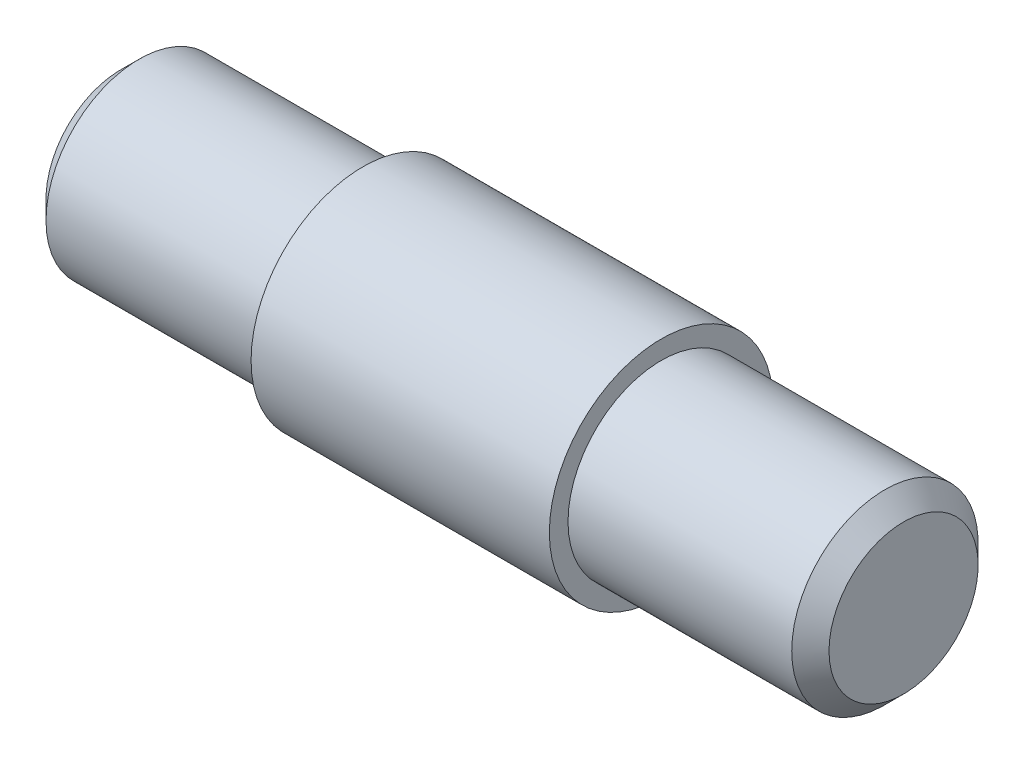
ISO-10303-21;
HEADER;
FILE_DESCRIPTION(('STEP AP214'),'2;1');
FILE_NAME('part.step','',(''),(''),'','','');
FILE_SCHEMA(('AUTOMOTIVE_DESIGN { 1 0 10303 214 1 1 1 1 }'));
ENDSEC;
DATA;
#1=APPLICATION_CONTEXT('core data for automotive mechanical design processes');
#2=APPLICATION_PROTOCOL_DEFINITION('international standard','automotive_design',2000,#1);
#3=PRODUCT_CONTEXT('',#1,'mechanical');
#4=PRODUCT('Part','Part','',(#3));
#5=PRODUCT_RELATED_PRODUCT_CATEGORY('part','',(#4));
#6=PRODUCT_DEFINITION_FORMATION('','',#4);
#7=PRODUCT_DEFINITION_CONTEXT('part definition',#1,'design');
#8=PRODUCT_DEFINITION('design','',#6,#7);
#9=PRODUCT_DEFINITION_SHAPE('','',#8);
#10=(LENGTH_UNIT() NAMED_UNIT(*) SI_UNIT(.MILLI.,.METRE.));
#11=(NAMED_UNIT(*) PLANE_ANGLE_UNIT() SI_UNIT($,.RADIAN.));
#12=(NAMED_UNIT(*) SI_UNIT($,.STERADIAN.) SOLID_ANGLE_UNIT());
#13=UNCERTAINTY_MEASURE_WITH_UNIT(LENGTH_MEASURE(1.E-05),#10,'distance_accuracy_value','');
#14=(GEOMETRIC_REPRESENTATION_CONTEXT(3) GLOBAL_UNCERTAINTY_ASSIGNED_CONTEXT((#13)) GLOBAL_UNIT_ASSIGNED_CONTEXT((#10,
#11,#12)) REPRESENTATION_CONTEXT('',''));
#15=CARTESIAN_POINT('',(0.,0.,0.));
#16=DIRECTION('',(0.,0.,1.));
#17=DIRECTION('',(1.,0.,0.));
#18=AXIS2_PLACEMENT_3D('',#15,#16,#17);
#19=CARTESIAN_POINT('',(0.,0.,0.));
#20=DIRECTION('',(1.,0.,0.));
#21=DIRECTION('',(0.,0.,-1.));
#22=AXIS2_PLACEMENT_3D('',#19,#20,#21);
#23=PLANE('',#22);
#24=CARTESIAN_POINT('',(0.,0.,0.));
#25=DIRECTION('',(1.,0.,0.));
#26=DIRECTION('',(0.,0.,-1.));
#27=AXIS2_PLACEMENT_3D('',#24,#25,#26);
#28=CIRCLE('',#27,2.);
#29=CARTESIAN_POINT('',(0.,0.,-2.));
#30=VERTEX_POINT('',#29);
#31=EDGE_CURVE('E39',#30,#30,#28,.F.);
#32=ORIENTED_EDGE('',*,*,#31,.T.);
#33=EDGE_LOOP('',(#32));
#34=FACE_BOUND('',#33,.T.);
#35=ADVANCED_FACE('F32',(#34),#23,.F.);
#36=CARTESIAN_POINT('',(-54.8246366619784,0.,0.));
#37=DIRECTION('',(-1.,0.,0.));
#38=DIRECTION('',(0.,0.,1.));
#39=AXIS2_PLACEMENT_3D('',#36,#37,#38);
#40=CYLINDRICAL_SURFACE('',#39,2.5);
#41=CARTESIAN_POINT('',(0.499999999999994,0.,0.));
#42=DIRECTION('',(1.,0.,0.));
#43=DIRECTION('',(0.,0.,-1.));
#44=AXIS2_PLACEMENT_3D('',#41,#42,#43);
#45=CIRCLE('',#44,2.5);
#46=CARTESIAN_POINT('',(0.499999999999994,0.,-2.5));
#47=VERTEX_POINT('',#46);
#48=EDGE_CURVE('E10',#47,#47,#45,.T.);
#49=ORIENTED_EDGE('',*,*,#48,.T.);
#50=EDGE_LOOP('',(#49));
#51=FACE_BOUND('',#50,.T.);
#52=CARTESIAN_POINT('',(6.5,0.,0.));
#53=DIRECTION('',(-1.,0.,0.));
#54=DIRECTION('',(0.,0.,1.));
#55=AXIS2_PLACEMENT_3D('',#52,#53,#54);
#56=CIRCLE('',#55,2.5);
#57=CARTESIAN_POINT('',(6.5,0.,2.5));
#58=VERTEX_POINT('',#57);
#59=EDGE_CURVE('E52',#58,#58,#56,.T.);
#60=ORIENTED_EDGE('',*,*,#59,.T.);
#61=EDGE_LOOP('',(#60));
#62=FACE_BOUND('',#61,.T.);
#63=ADVANCED_FACE('F83',(#51,#62),#40,.T.);
#64=CARTESIAN_POINT('',(6.5,2.5,0.));
#65=DIRECTION('',(1.,0.,0.));
#66=DIRECTION('',(0.,0.,-1.));
#67=AXIS2_PLACEMENT_3D('',#64,#65,#66);
#68=PLANE('',#67);
#69=ORIENTED_EDGE('',*,*,#59,.F.);
#70=EDGE_LOOP('',(#69));
#71=FACE_BOUND('',#70,.T.);
#72=CARTESIAN_POINT('',(6.5,0.,0.));
#73=DIRECTION('',(-1.,0.,0.));
#74=DIRECTION('',(0.,0.,1.));
#75=AXIS2_PLACEMENT_3D('',#72,#73,#74);
#76=CIRCLE('',#75,3.);
#77=CARTESIAN_POINT('',(6.5,0.,3.));
#78=VERTEX_POINT('',#77);
#79=EDGE_CURVE('E55',#78,#78,#76,.T.);
#80=ORIENTED_EDGE('',*,*,#79,.T.);
#81=EDGE_LOOP('',(#80));
#82=FACE_BOUND('',#81,.T.);
#83=ADVANCED_FACE('F88',(#71,#82),#68,.F.);
#84=CARTESIAN_POINT('',(-54.8246366619784,0.,0.));
#85=DIRECTION('',(-1.,0.,0.));
#86=DIRECTION('',(0.,0.,1.));
#87=AXIS2_PLACEMENT_3D('',#84,#85,#86);
#88=CYLINDRICAL_SURFACE('',#87,3.);
#89=ORIENTED_EDGE('',*,*,#79,.F.);
#90=EDGE_LOOP('',(#89));
#91=FACE_BOUND('',#90,.T.);
#92=CARTESIAN_POINT('',(14.5,0.,0.));
#93=DIRECTION('',(-1.,0.,0.));
#94=DIRECTION('',(0.,0.,1.));
#95=AXIS2_PLACEMENT_3D('',#92,#93,#94);
#96=CIRCLE('',#95,3.);
#97=CARTESIAN_POINT('',(14.5,0.,3.));
#98=VERTEX_POINT('',#97);
#99=EDGE_CURVE('E58',#98,#98,#96,.T.);
#100=ORIENTED_EDGE('',*,*,#99,.T.);
#101=EDGE_LOOP('',(#100));
#102=FACE_BOUND('',#101,.T.);
#103=ADVANCED_FACE('F79',(#91,#102),#88,.T.);
#104=CARTESIAN_POINT('',(14.5,3.,0.));
#105=DIRECTION('',(-1.,0.,0.));
#106=DIRECTION('',(0.,0.,1.));
#107=AXIS2_PLACEMENT_3D('',#104,#105,#106);
#108=PLANE('',#107);
#109=ORIENTED_EDGE('',*,*,#99,.F.);
#110=EDGE_LOOP('',(#109));
#111=FACE_BOUND('',#110,.T.);
#112=CARTESIAN_POINT('',(14.5,0.,0.));
#113=DIRECTION('',(-1.,0.,0.));
#114=DIRECTION('',(0.,0.,1.));
#115=AXIS2_PLACEMENT_3D('',#112,#113,#114);
#116=CIRCLE('',#115,2.5);
#117=CARTESIAN_POINT('',(14.5,0.,2.5));
#118=VERTEX_POINT('',#117);
#119=EDGE_CURVE('E61',#118,#118,#116,.T.);
#120=ORIENTED_EDGE('',*,*,#119,.T.);
#121=EDGE_LOOP('',(#120));
#122=FACE_BOUND('',#121,.T.);
#123=ADVANCED_FACE('F65',(#111,#122),#108,.F.);
#124=CARTESIAN_POINT('',(-54.8246366619784,0.,0.));
#125=DIRECTION('',(-1.,0.,0.));
#126=DIRECTION('',(0.,0.,1.));
#127=AXIS2_PLACEMENT_3D('',#124,#125,#126);
#128=CYLINDRICAL_SURFACE('',#127,2.5);
#129=CARTESIAN_POINT('',(20.5,0.,0.));
#130=DIRECTION('',(-1.,0.,0.));
#131=DIRECTION('',(0.,0.,1.));
#132=AXIS2_PLACEMENT_3D('',#129,#130,#131);
#133=CIRCLE('',#132,2.5);
#134=CARTESIAN_POINT('',(20.5,0.,2.5));
#135=VERTEX_POINT('',#134);
#136=EDGE_CURVE('E47',#135,#135,#133,.T.);
#137=ORIENTED_EDGE('',*,*,#136,.T.);
#138=EDGE_LOOP('',(#137));
#139=FACE_BOUND('',#138,.T.);
#140=ORIENTED_EDGE('',*,*,#119,.F.);
#141=EDGE_LOOP('',(#140));
#142=FACE_BOUND('',#141,.T.);
#143=ADVANCED_FACE('F67',(#139,#142),#128,.T.);
#144=CARTESIAN_POINT('',(21.,2.5,0.));
#145=DIRECTION('',(-1.,0.,0.));
#146=DIRECTION('',(0.,0.,1.));
#147=AXIS2_PLACEMENT_3D('',#144,#145,#146);
#148=PLANE('',#147);
#149=CARTESIAN_POINT('',(21.,0.,0.));
#150=DIRECTION('',(-1.,0.,0.));
#151=DIRECTION('',(0.,0.,1.));
#152=AXIS2_PLACEMENT_3D('',#149,#150,#151);
#153=CIRCLE('',#152,1.99999999999999);
#154=CARTESIAN_POINT('',(21.,0.,1.99999999999999));
#155=VERTEX_POINT('',#154);
#156=EDGE_CURVE('E43',#155,#155,#153,.F.);
#157=ORIENTED_EDGE('',*,*,#156,.T.);
#158=EDGE_LOOP('',(#157));
#159=FACE_BOUND('',#158,.T.);
#160=ADVANCED_FACE('F69',(#159),#148,.F.);
#161=CARTESIAN_POINT('',(20.5,0.,0.));
#162=DIRECTION('',(-1.,0.,0.));
#163=DIRECTION('',(0.,0.,1.));
#164=AXIS2_PLACEMENT_3D('',#161,#162,#163);
#165=CONICAL_SURFACE('',#164,2.5,0.785398163397463);
#166=ORIENTED_EDGE('',*,*,#156,.F.);
#167=EDGE_LOOP('',(#166));
#168=FACE_BOUND('',#167,.T.);
#169=ORIENTED_EDGE('',*,*,#136,.F.);
#170=EDGE_LOOP('',(#169));
#171=FACE_BOUND('',#170,.T.);
#172=ADVANCED_FACE('F76',(#168,#171),#165,.T.);
#173=CARTESIAN_POINT('',(0.,0.,0.));
#174=DIRECTION('',(1.,0.,0.));
#175=DIRECTION('',(0.,0.,-1.));
#176=AXIS2_PLACEMENT_3D('',#173,#174,#175);
#177=CONICAL_SURFACE('',#176,2.,0.78539816339745);
#178=ORIENTED_EDGE('',*,*,#48,.F.);
#179=EDGE_LOOP('',(#178));
#180=FACE_BOUND('',#179,.T.);
#181=ORIENTED_EDGE('',*,*,#31,.F.);
#182=EDGE_LOOP('',(#181));
#183=FACE_BOUND('',#182,.T.);
#184=ADVANCED_FACE('F34',(#180,#183),#177,.T.);
#185=CLOSED_SHELL('',(#35,#63,#83,#103,#123,#143,#160,#172,#184));
#186=MANIFOLD_SOLID_BREP('B2',#185);
#187=ADVANCED_BREP_SHAPE_REPRESENTATION('',(#18,#186),#14);
#188=SHAPE_DEFINITION_REPRESENTATION(#9,#187);
ENDSEC;
END-ISO-10303-21;
